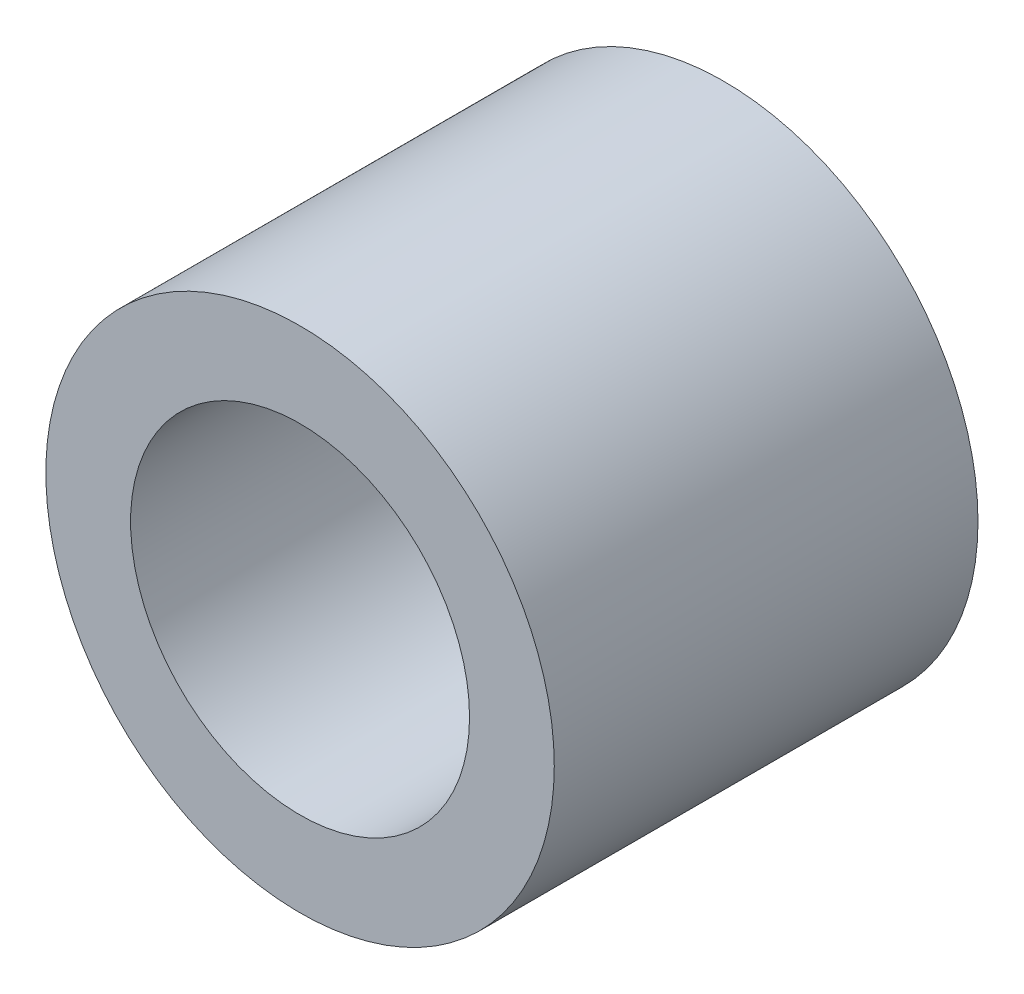
ISO-10303-21;
HEADER;
FILE_DESCRIPTION(('STEP AP214'),'2;1');
FILE_NAME('part.step','',(''),(''),'','','');
FILE_SCHEMA(('AUTOMOTIVE_DESIGN { 1 0 10303 214 1 1 1 1 }'));
ENDSEC;
DATA;
#1=APPLICATION_CONTEXT('core data for automotive mechanical design processes');
#2=APPLICATION_PROTOCOL_DEFINITION('international standard','automotive_design',2000,#1);
#3=PRODUCT_CONTEXT('',#1,'mechanical');
#4=PRODUCT('Part','Part','',(#3));
#5=PRODUCT_RELATED_PRODUCT_CATEGORY('part','',(#4));
#6=PRODUCT_DEFINITION_FORMATION('','',#4);
#7=PRODUCT_DEFINITION_CONTEXT('part definition',#1,'design');
#8=PRODUCT_DEFINITION('design','',#6,#7);
#9=PRODUCT_DEFINITION_SHAPE('','',#8);
#10=(LENGTH_UNIT() NAMED_UNIT(*) SI_UNIT(.MILLI.,.METRE.));
#11=(NAMED_UNIT(*) PLANE_ANGLE_UNIT() SI_UNIT($,.RADIAN.));
#12=(NAMED_UNIT(*) SI_UNIT($,.STERADIAN.) SOLID_ANGLE_UNIT());
#13=UNCERTAINTY_MEASURE_WITH_UNIT(LENGTH_MEASURE(1.E-05),#10,'distance_accuracy_value','');
#14=(GEOMETRIC_REPRESENTATION_CONTEXT(3) GLOBAL_UNCERTAINTY_ASSIGNED_CONTEXT((#13)) GLOBAL_UNIT_ASSIGNED_CONTEXT((#10,
#11,#12)) REPRESENTATION_CONTEXT('',''));
#15=CARTESIAN_POINT('',(0.,0.,0.));
#16=DIRECTION('',(0.,0.,1.));
#17=DIRECTION('',(1.,0.,0.));
#18=AXIS2_PLACEMENT_3D('',#15,#16,#17);
#19=CARTESIAN_POINT('',(0.,0.,25.));
#20=DIRECTION('',(0.,0.,1.));
#21=DIRECTION('',(1.,0.,0.));
#22=AXIS2_PLACEMENT_3D('',#19,#20,#21);
#23=PLANE('',#22);
#24=CARTESIAN_POINT('',(0.,0.,25.));
#25=DIRECTION('',(0.,0.,1.));
#26=DIRECTION('',(1.,0.,0.));
#27=AXIS2_PLACEMENT_3D('',#24,#25,#26);
#28=CIRCLE('',#27,30.);
#29=CARTESIAN_POINT('',(30.,0.,25.));
#30=VERTEX_POINT('',#29);
#31=EDGE_CURVE('E10',#30,#30,#28,.T.);
#32=ORIENTED_EDGE('',*,*,#31,.T.);
#33=EDGE_LOOP('',(#32));
#34=FACE_BOUND('',#33,.T.);
#35=CARTESIAN_POINT('',(0.,0.,25.));
#36=DIRECTION('',(0.,0.,1.));
#37=DIRECTION('',(1.,0.,0.));
#38=AXIS2_PLACEMENT_3D('',#35,#36,#37);
#39=CIRCLE('',#38,20.);
#40=CARTESIAN_POINT('',(20.,0.,25.));
#41=VERTEX_POINT('',#40);
#42=EDGE_CURVE('E42',#41,#41,#39,.T.);
#43=ORIENTED_EDGE('',*,*,#42,.F.);
#44=EDGE_LOOP('',(#43));
#45=FACE_BOUND('',#44,.T.);
#46=ADVANCED_FACE('F31',(#34,#45),#23,.T.);
#47=CARTESIAN_POINT('',(0.,0.,-25.));
#48=DIRECTION('',(0.,0.,1.));
#49=DIRECTION('',(1.,0.,0.));
#50=AXIS2_PLACEMENT_3D('',#47,#48,#49);
#51=PLANE('',#50);
#52=CARTESIAN_POINT('',(0.,0.,-25.));
#53=DIRECTION('',(0.,0.,1.));
#54=DIRECTION('',(1.,0.,0.));
#55=AXIS2_PLACEMENT_3D('',#52,#53,#54);
#56=CIRCLE('',#55,30.);
#57=CARTESIAN_POINT('',(30.,0.,-25.));
#58=VERTEX_POINT('',#57);
#59=EDGE_CURVE('E35',#58,#58,#56,.T.);
#60=ORIENTED_EDGE('',*,*,#59,.F.);
#61=EDGE_LOOP('',(#60));
#62=FACE_BOUND('',#61,.T.);
#63=CARTESIAN_POINT('',(0.,0.,-25.));
#64=DIRECTION('',(0.,0.,1.));
#65=DIRECTION('',(1.,0.,0.));
#66=AXIS2_PLACEMENT_3D('',#63,#64,#65);
#67=CIRCLE('',#66,20.);
#68=CARTESIAN_POINT('',(20.,0.,-25.));
#69=VERTEX_POINT('',#68);
#70=EDGE_CURVE('E44',#69,#69,#67,.T.);
#71=ORIENTED_EDGE('',*,*,#70,.T.);
#72=EDGE_LOOP('',(#71));
#73=FACE_BOUND('',#72,.T.);
#74=ADVANCED_FACE('F54',(#62,#73),#51,.F.);
#75=CARTESIAN_POINT('',(0.,0.,25.));
#76=DIRECTION('',(0.,0.,-1.));
#77=DIRECTION('',(-1.,0.,0.));
#78=AXIS2_PLACEMENT_3D('',#75,#76,#77);
#79=CYLINDRICAL_SURFACE('',#78,30.);
#80=ORIENTED_EDGE('',*,*,#31,.F.);
#81=EDGE_LOOP('',(#80));
#82=FACE_BOUND('',#81,.T.);
#83=ORIENTED_EDGE('',*,*,#59,.T.);
#84=EDGE_LOOP('',(#83));
#85=FACE_BOUND('',#84,.T.);
#86=ADVANCED_FACE('F33',(#82,#85),#79,.T.);
#87=CARTESIAN_POINT('',(0.,0.,25.));
#88=DIRECTION('',(0.,0.,-1.));
#89=DIRECTION('',(-1.,0.,0.));
#90=AXIS2_PLACEMENT_3D('',#87,#88,#89);
#91=CYLINDRICAL_SURFACE('',#90,20.);
#92=ORIENTED_EDGE('',*,*,#42,.T.);
#93=EDGE_LOOP('',(#92));
#94=FACE_BOUND('',#93,.T.);
#95=ORIENTED_EDGE('',*,*,#70,.F.);
#96=EDGE_LOOP('',(#95));
#97=FACE_BOUND('',#96,.T.);
#98=ADVANCED_FACE('F50',(#94,#97),#91,.F.);
#99=CLOSED_SHELL('',(#46,#74,#86,#98));
#100=MANIFOLD_SOLID_BREP('B2',#99);
#101=ADVANCED_BREP_SHAPE_REPRESENTATION('',(#18,#100),#14);
#102=SHAPE_DEFINITION_REPRESENTATION(#9,#101);
ENDSEC;
END-ISO-10303-21;
